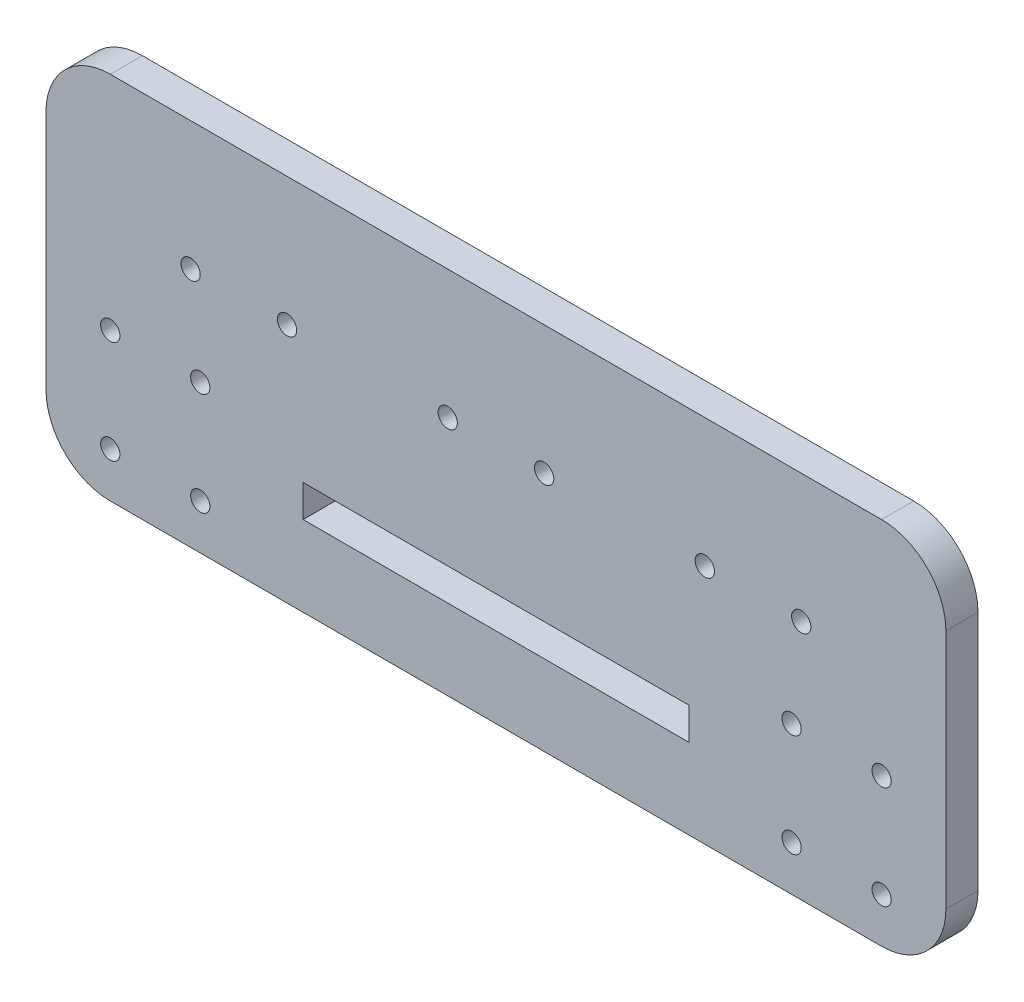
ISO-10303-21;
HEADER;
FILE_DESCRIPTION(('STEP AP214'),'2;1');
FILE_NAME('part.step','',(''),(''),'','','');
FILE_SCHEMA(('AUTOMOTIVE_DESIGN { 1 0 10303 214 1 1 1 1 }'));
ENDSEC;
DATA;
#1=APPLICATION_CONTEXT('core data for automotive mechanical design processes');
#2=APPLICATION_PROTOCOL_DEFINITION('international standard','automotive_design',2000,#1);
#3=PRODUCT_CONTEXT('',#1,'mechanical');
#4=PRODUCT('Part','Part','',(#3));
#5=PRODUCT_RELATED_PRODUCT_CATEGORY('part','',(#4));
#6=PRODUCT_DEFINITION_FORMATION('','',#4);
#7=PRODUCT_DEFINITION_CONTEXT('part definition',#1,'design');
#8=PRODUCT_DEFINITION('design','',#6,#7);
#9=PRODUCT_DEFINITION_SHAPE('','',#8);
#10=(LENGTH_UNIT() NAMED_UNIT(*) SI_UNIT(.MILLI.,.METRE.));
#11=(NAMED_UNIT(*) PLANE_ANGLE_UNIT() SI_UNIT($,.RADIAN.));
#12=(NAMED_UNIT(*) SI_UNIT($,.STERADIAN.) SOLID_ANGLE_UNIT());
#13=UNCERTAINTY_MEASURE_WITH_UNIT(LENGTH_MEASURE(1.E-05),#10,'distance_accuracy_value','');
#14=(GEOMETRIC_REPRESENTATION_CONTEXT(3) GLOBAL_UNCERTAINTY_ASSIGNED_CONTEXT((#13)) GLOBAL_UNIT_ASSIGNED_CONTEXT((#10,
#11,#12)) REPRESENTATION_CONTEXT('',''));
#15=CARTESIAN_POINT('',(0.,0.,0.));
#16=DIRECTION('',(0.,0.,1.));
#17=DIRECTION('',(1.,0.,0.));
#18=AXIS2_PLACEMENT_3D('',#15,#16,#17);
#19=CARTESIAN_POINT('',(-60.,-18.75,5.));
#20=DIRECTION('',(0.,0.,-1.));
#21=DIRECTION('',(-1.,0.,0.));
#22=AXIS2_PLACEMENT_3D('',#19,#20,#21);
#23=CYLINDRICAL_SURFACE('',#22,10.);
#24=CARTESIAN_POINT('',(-60.,-18.75,0.));
#25=DIRECTION('',(0.,0.,1.));
#26=DIRECTION('',(1.,0.,0.));
#27=AXIS2_PLACEMENT_3D('',#24,#25,#26);
#28=CIRCLE('',#27,10.);
#29=CARTESIAN_POINT('',(-70.,-18.75,0.));
#30=VERTEX_POINT('',#29);
#31=CARTESIAN_POINT('',(-60.,-28.75,0.));
#32=VERTEX_POINT('',#31);
#33=EDGE_CURVE('E195',#30,#32,#28,.T.);
#34=ORIENTED_EDGE('',*,*,#33,.T.);
#35=DIRECTION('',(0.,0.,-1.));
#36=VECTOR('',#35,1.);
#37=CARTESIAN_POINT('',(-60.,-28.75,5.));
#38=LINE('',#37,#36);
#39=CARTESIAN_POINT('',(-60.,-28.75,5.));
#40=VERTEX_POINT('',#39);
#41=EDGE_CURVE('E11',#40,#32,#38,.T.);
#42=ORIENTED_EDGE('',*,*,#41,.F.);
#43=CARTESIAN_POINT('',(-60.,-18.75,5.));
#44=DIRECTION('',(0.,0.,1.));
#45=DIRECTION('',(1.,0.,0.));
#46=AXIS2_PLACEMENT_3D('',#43,#44,#45);
#47=CIRCLE('',#46,10.);
#48=CARTESIAN_POINT('',(-70.,-18.75,5.));
#49=VERTEX_POINT('',#48);
#50=EDGE_CURVE('E198',#49,#40,#47,.T.);
#51=ORIENTED_EDGE('',*,*,#50,.F.);
#52=DIRECTION('',(0.,0.,-1.));
#53=VECTOR('',#52,1.);
#54=CARTESIAN_POINT('',(-70.,-18.75,5.));
#55=LINE('',#54,#53);
#56=EDGE_CURVE('E216',#49,#30,#55,.T.);
#57=ORIENTED_EDGE('',*,*,#56,.T.);
#58=EDGE_LOOP('',(#34,#42,#51,#57));
#59=FACE_BOUND('',#58,.T.);
#60=ADVANCED_FACE('F38',(#59),#23,.T.);
#61=CARTESIAN_POINT('',(-60.,-28.75,5.));
#62=DIRECTION('',(0.,1.,0.));
#63=DIRECTION('',(0.,0.,1.));
#64=AXIS2_PLACEMENT_3D('',#61,#62,#63);
#65=PLANE('',#64);
#66=DIRECTION('',(1.,0.,0.));
#67=VECTOR('',#66,1.);
#68=CARTESIAN_POINT('',(-60.,-28.75,0.));
#69=LINE('',#68,#67);
#70=CARTESIAN_POINT('',(60.,-28.75,0.));
#71=VERTEX_POINT('',#70);
#72=EDGE_CURVE('E219',#32,#71,#69,.T.);
#73=ORIENTED_EDGE('',*,*,#72,.T.);
#74=DIRECTION('',(0.,0.,-1.));
#75=VECTOR('',#74,1.);
#76=CARTESIAN_POINT('',(60.,-28.75,5.));
#77=LINE('',#76,#75);
#78=CARTESIAN_POINT('',(60.,-28.75,5.));
#79=VERTEX_POINT('',#78);
#80=EDGE_CURVE('E45',#79,#71,#77,.T.);
#81=ORIENTED_EDGE('',*,*,#80,.F.);
#82=DIRECTION('',(1.,0.,0.));
#83=VECTOR('',#82,1.);
#84=CARTESIAN_POINT('',(-60.,-28.75,5.));
#85=LINE('',#84,#83);
#86=EDGE_CURVE('E201',#40,#79,#85,.T.);
#87=ORIENTED_EDGE('',*,*,#86,.F.);
#88=ORIENTED_EDGE('',*,*,#41,.T.);
#89=EDGE_LOOP('',(#73,#81,#87,#88));
#90=FACE_BOUND('',#89,.T.);
#91=ADVANCED_FACE('F275',(#90),#65,.F.);
#92=CARTESIAN_POINT('',(60.,-18.75,5.));
#93=DIRECTION('',(0.,0.,-1.));
#94=DIRECTION('',(-1.,0.,0.));
#95=AXIS2_PLACEMENT_3D('',#92,#93,#94);
#96=CYLINDRICAL_SURFACE('',#95,10.);
#97=CARTESIAN_POINT('',(60.,-18.75,0.));
#98=DIRECTION('',(0.,0.,1.));
#99=DIRECTION('',(1.,0.,0.));
#100=AXIS2_PLACEMENT_3D('',#97,#98,#99);
#101=CIRCLE('',#100,10.);
#102=CARTESIAN_POINT('',(70.,-18.75,0.));
#103=VERTEX_POINT('',#102);
#104=EDGE_CURVE('E221',#71,#103,#101,.T.);
#105=ORIENTED_EDGE('',*,*,#104,.T.);
#106=DIRECTION('',(0.,0.,-1.));
#107=VECTOR('',#106,1.);
#108=CARTESIAN_POINT('',(70.,-18.75,5.));
#109=LINE('',#108,#107);
#110=CARTESIAN_POINT('',(70.,-18.75,5.));
#111=VERTEX_POINT('',#110);
#112=EDGE_CURVE('E246',#111,#103,#109,.T.);
#113=ORIENTED_EDGE('',*,*,#112,.F.);
#114=CARTESIAN_POINT('',(60.,-18.75,5.));
#115=DIRECTION('',(0.,0.,1.));
#116=DIRECTION('',(1.,0.,0.));
#117=AXIS2_PLACEMENT_3D('',#114,#115,#116);
#118=CIRCLE('',#117,10.);
#119=EDGE_CURVE('E204',#79,#111,#118,.T.);
#120=ORIENTED_EDGE('',*,*,#119,.F.);
#121=ORIENTED_EDGE('',*,*,#80,.T.);
#122=EDGE_LOOP('',(#105,#113,#120,#121));
#123=FACE_BOUND('',#122,.T.);
#124=ADVANCED_FACE('F253',(#123),#96,.T.);
#125=CARTESIAN_POINT('',(70.,18.75,5.));
#126=DIRECTION('',(-1.,0.,0.));
#127=DIRECTION('',(0.,0.,1.));
#128=AXIS2_PLACEMENT_3D('',#125,#126,#127);
#129=PLANE('',#128);
#130=DIRECTION('',(0.,1.,0.));
#131=VECTOR('',#130,1.);
#132=CARTESIAN_POINT('',(70.,18.75,0.));
#133=LINE('',#132,#131);
#134=CARTESIAN_POINT('',(70.,18.75,0.));
#135=VERTEX_POINT('',#134);
#136=EDGE_CURVE('E223',#103,#135,#133,.T.);
#137=ORIENTED_EDGE('',*,*,#136,.T.);
#138=DIRECTION('',(0.,0.,-1.));
#139=VECTOR('',#138,1.);
#140=CARTESIAN_POINT('',(70.,18.75,5.));
#141=LINE('',#140,#139);
#142=CARTESIAN_POINT('',(70.,18.75,5.));
#143=VERTEX_POINT('',#142);
#144=EDGE_CURVE('E243',#143,#135,#141,.T.);
#145=ORIENTED_EDGE('',*,*,#144,.F.);
#146=DIRECTION('',(0.,1.,0.));
#147=VECTOR('',#146,1.);
#148=CARTESIAN_POINT('',(70.,18.75,5.));
#149=LINE('',#148,#147);
#150=EDGE_CURVE('E206',#111,#143,#149,.T.);
#151=ORIENTED_EDGE('',*,*,#150,.F.);
#152=ORIENTED_EDGE('',*,*,#112,.T.);
#153=EDGE_LOOP('',(#137,#145,#151,#152));
#154=FACE_BOUND('',#153,.T.);
#155=ADVANCED_FACE('F263',(#154),#129,.F.);
#156=CARTESIAN_POINT('',(60.,18.75,5.));
#157=DIRECTION('',(0.,0.,-1.));
#158=DIRECTION('',(-1.,0.,0.));
#159=AXIS2_PLACEMENT_3D('',#156,#157,#158);
#160=CYLINDRICAL_SURFACE('',#159,10.);
#161=CARTESIAN_POINT('',(60.,18.75,0.));
#162=DIRECTION('',(0.,0.,1.));
#163=DIRECTION('',(-1.,0.,0.));
#164=AXIS2_PLACEMENT_3D('',#161,#162,#163);
#165=CIRCLE('',#164,10.);
#166=CARTESIAN_POINT('',(60.,28.75,0.));
#167=VERTEX_POINT('',#166);
#168=EDGE_CURVE('E225',#135,#167,#165,.T.);
#169=ORIENTED_EDGE('',*,*,#168,.T.);
#170=DIRECTION('',(0.,0.,-1.));
#171=VECTOR('',#170,1.);
#172=CARTESIAN_POINT('',(60.,28.75,5.));
#173=LINE('',#172,#171);
#174=CARTESIAN_POINT('',(60.,28.75,5.));
#175=VERTEX_POINT('',#174);
#176=EDGE_CURVE('E240',#175,#167,#173,.T.);
#177=ORIENTED_EDGE('',*,*,#176,.F.);
#178=CARTESIAN_POINT('',(60.,18.75,5.));
#179=DIRECTION('',(0.,0.,1.));
#180=DIRECTION('',(-1.,0.,0.));
#181=AXIS2_PLACEMENT_3D('',#178,#179,#180);
#182=CIRCLE('',#181,10.);
#183=EDGE_CURVE('E208',#143,#175,#182,.T.);
#184=ORIENTED_EDGE('',*,*,#183,.F.);
#185=ORIENTED_EDGE('',*,*,#144,.T.);
#186=EDGE_LOOP('',(#169,#177,#184,#185));
#187=FACE_BOUND('',#186,.T.);
#188=ADVANCED_FACE('F267',(#187),#160,.T.);
#189=CARTESIAN_POINT('',(-60.,28.75,5.));
#190=DIRECTION('',(0.,-1.,0.));
#191=DIRECTION('',(0.,0.,-1.));
#192=AXIS2_PLACEMENT_3D('',#189,#190,#191);
#193=PLANE('',#192);
#194=DIRECTION('',(-1.,0.,0.));
#195=VECTOR('',#194,1.);
#196=CARTESIAN_POINT('',(-60.,28.75,0.));
#197=LINE('',#196,#195);
#198=CARTESIAN_POINT('',(-60.,28.75,0.));
#199=VERTEX_POINT('',#198);
#200=EDGE_CURVE('E227',#167,#199,#197,.T.);
#201=ORIENTED_EDGE('',*,*,#200,.T.);
#202=DIRECTION('',(0.,0.,-1.));
#203=VECTOR('',#202,1.);
#204=CARTESIAN_POINT('',(-60.,28.75,5.));
#205=LINE('',#204,#203);
#206=CARTESIAN_POINT('',(-60.,28.75,5.));
#207=VERTEX_POINT('',#206);
#208=EDGE_CURVE('E237',#207,#199,#205,.T.);
#209=ORIENTED_EDGE('',*,*,#208,.F.);
#210=DIRECTION('',(-1.,0.,0.));
#211=VECTOR('',#210,1.);
#212=CARTESIAN_POINT('',(-60.,28.75,5.));
#213=LINE('',#212,#211);
#214=EDGE_CURVE('E210',#175,#207,#213,.T.);
#215=ORIENTED_EDGE('',*,*,#214,.F.);
#216=ORIENTED_EDGE('',*,*,#176,.T.);
#217=EDGE_LOOP('',(#201,#209,#215,#216));
#218=FACE_BOUND('',#217,.T.);
#219=ADVANCED_FACE('F288',(#218),#193,.F.);
#220=CARTESIAN_POINT('',(-60.,18.75,5.));
#221=DIRECTION('',(0.,0.,-1.));
#222=DIRECTION('',(-1.,0.,0.));
#223=AXIS2_PLACEMENT_3D('',#220,#221,#222);
#224=CYLINDRICAL_SURFACE('',#223,10.);
#225=CARTESIAN_POINT('',(-60.,18.75,0.));
#226=DIRECTION('',(0.,0.,1.));
#227=DIRECTION('',(1.,0.,0.));
#228=AXIS2_PLACEMENT_3D('',#225,#226,#227);
#229=CIRCLE('',#228,10.);
#230=CARTESIAN_POINT('',(-70.,18.75,0.));
#231=VERTEX_POINT('',#230);
#232=EDGE_CURVE('E229',#199,#231,#229,.T.);
#233=ORIENTED_EDGE('',*,*,#232,.T.);
#234=DIRECTION('',(0.,0.,-1.));
#235=VECTOR('',#234,1.);
#236=CARTESIAN_POINT('',(-70.,18.75,5.));
#237=LINE('',#236,#235);
#238=CARTESIAN_POINT('',(-70.,18.75,5.));
#239=VERTEX_POINT('',#238);
#240=EDGE_CURVE('E234',#239,#231,#237,.T.);
#241=ORIENTED_EDGE('',*,*,#240,.F.);
#242=CARTESIAN_POINT('',(-60.,18.75,5.));
#243=DIRECTION('',(0.,0.,1.));
#244=DIRECTION('',(1.,0.,0.));
#245=AXIS2_PLACEMENT_3D('',#242,#243,#244);
#246=CIRCLE('',#245,10.);
#247=EDGE_CURVE('E212',#207,#239,#246,.T.);
#248=ORIENTED_EDGE('',*,*,#247,.F.);
#249=ORIENTED_EDGE('',*,*,#208,.T.);
#250=EDGE_LOOP('',(#233,#241,#248,#249));
#251=FACE_BOUND('',#250,.T.);
#252=ADVANCED_FACE('F286',(#251),#224,.T.);
#253=CARTESIAN_POINT('',(-70.,18.75,5.));
#254=DIRECTION('',(1.,0.,0.));
#255=DIRECTION('',(0.,1.,0.));
#256=AXIS2_PLACEMENT_3D('',#253,#254,#255);
#257=PLANE('',#256);
#258=DIRECTION('',(0.,-1.,0.));
#259=VECTOR('',#258,1.);
#260=CARTESIAN_POINT('',(-70.,18.75,0.));
#261=LINE('',#260,#259);
#262=EDGE_CURVE('E202',#231,#30,#261,.T.);
#263=ORIENTED_EDGE('',*,*,#262,.T.);
#264=ORIENTED_EDGE('',*,*,#56,.F.);
#265=DIRECTION('',(0.,-1.,0.));
#266=VECTOR('',#265,1.);
#267=CARTESIAN_POINT('',(-70.,18.75,5.));
#268=LINE('',#267,#266);
#269=EDGE_CURVE('E214',#239,#49,#268,.T.);
#270=ORIENTED_EDGE('',*,*,#269,.F.);
#271=ORIENTED_EDGE('',*,*,#240,.T.);
#272=EDGE_LOOP('',(#263,#264,#270,#271));
#273=FACE_BOUND('',#272,.T.);
#274=ADVANCED_FACE('F281',(#273),#257,.F.);
#275=CARTESIAN_POINT('',(-60.,-18.75,5.));
#276=DIRECTION('',(0.,0.,1.));
#277=DIRECTION('',(1.,0.,0.));
#278=AXIS2_PLACEMENT_3D('',#275,#276,#277);
#279=PLANE('',#278);
#280=CARTESIAN_POINT('',(-47.5,8.75000000000002,5.));
#281=DIRECTION('',(0.,0.,1.));
#282=DIRECTION('',(-1.,0.,0.));
#283=AXIS2_PLACEMENT_3D('',#280,#281,#282);
#284=CIRCLE('',#283,1.5);
#285=CARTESIAN_POINT('',(-49.,8.75000000000002,5.));
#286=VERTEX_POINT('',#285);
#287=EDGE_CURVE('E532',#286,#286,#284,.T.);
#288=ORIENTED_EDGE('',*,*,#287,.F.);
#289=EDGE_LOOP('',(#288));
#290=FACE_BOUND('',#289,.T.);
#291=CARTESIAN_POINT('',(-7.5,8.74999999999999,5.));
#292=DIRECTION('',(0.,0.,1.));
#293=DIRECTION('',(-1.,0.,0.));
#294=AXIS2_PLACEMENT_3D('',#291,#292,#293);
#295=CIRCLE('',#294,1.5);
#296=CARTESIAN_POINT('',(-9.,8.74999999999999,5.));
#297=VERTEX_POINT('',#296);
#298=EDGE_CURVE('E581',#297,#297,#295,.T.);
#299=ORIENTED_EDGE('',*,*,#298,.F.);
#300=EDGE_LOOP('',(#299));
#301=FACE_BOUND('',#300,.T.);
#302=CARTESIAN_POINT('',(47.5,8.75000000000002,5.));
#303=DIRECTION('',(0.,0.,1.));
#304=DIRECTION('',(1.,0.,0.));
#305=AXIS2_PLACEMENT_3D('',#302,#303,#304);
#306=CIRCLE('',#305,1.5);
#307=CARTESIAN_POINT('',(49.,8.75000000000002,5.));
#308=VERTEX_POINT('',#307);
#309=EDGE_CURVE('E592',#308,#308,#306,.T.);
#310=ORIENTED_EDGE('',*,*,#309,.F.);
#311=EDGE_LOOP('',(#310));
#312=FACE_BOUND('',#311,.T.);
#313=CARTESIAN_POINT('',(32.5,8.75000000000002,5.));
#314=DIRECTION('',(0.,0.,1.));
#315=DIRECTION('',(-1.,0.,0.));
#316=AXIS2_PLACEMENT_3D('',#313,#314,#315);
#317=CIRCLE('',#316,1.5);
#318=CARTESIAN_POINT('',(31.,8.75000000000002,5.));
#319=VERTEX_POINT('',#318);
#320=EDGE_CURVE('E598',#319,#319,#317,.T.);
#321=ORIENTED_EDGE('',*,*,#320,.F.);
#322=EDGE_LOOP('',(#321));
#323=FACE_BOUND('',#322,.T.);
#324=CARTESIAN_POINT('',(-32.5,8.75000000000002,5.));
#325=DIRECTION('',(0.,0.,1.));
#326=DIRECTION('',(1.,0.,0.));
#327=AXIS2_PLACEMENT_3D('',#324,#325,#326);
#328=CIRCLE('',#327,1.5);
#329=CARTESIAN_POINT('',(-31.,8.75000000000002,5.));
#330=VERTEX_POINT('',#329);
#331=EDGE_CURVE('E534',#330,#330,#328,.T.);
#332=ORIENTED_EDGE('',*,*,#331,.F.);
#333=EDGE_LOOP('',(#332));
#334=FACE_BOUND('',#333,.T.);
#335=CARTESIAN_POINT('',(7.5,8.74999999999999,5.));
#336=DIRECTION('',(0.,0.,1.));
#337=DIRECTION('',(1.,0.,0.));
#338=AXIS2_PLACEMENT_3D('',#335,#336,#337);
#339=CIRCLE('',#338,1.5);
#340=CARTESIAN_POINT('',(9.,8.74999999999999,5.));
#341=VERTEX_POINT('',#340);
#342=EDGE_CURVE('E540',#341,#341,#339,.T.);
#343=ORIENTED_EDGE('',*,*,#342,.F.);
#344=EDGE_LOOP('',(#343));
#345=FACE_BOUND('',#344,.T.);
#346=CARTESIAN_POINT('',(-46.,-5.75000000000001,5.));
#347=DIRECTION('',(0.,0.,1.));
#348=DIRECTION('',(-1.,0.,0.));
#349=AXIS2_PLACEMENT_3D('',#346,#347,#348);
#350=CIRCLE('',#349,1.5);
#351=CARTESIAN_POINT('',(-47.5,-5.75000000000001,5.));
#352=VERTEX_POINT('',#351);
#353=EDGE_CURVE('E176',#352,#352,#350,.T.);
#354=ORIENTED_EDGE('',*,*,#353,.F.);
#355=EDGE_LOOP('',(#354));
#356=FACE_BOUND('',#355,.T.);
#357=CARTESIAN_POINT('',(60.,-21.75,5.));
#358=DIRECTION('',(0.,0.,1.));
#359=DIRECTION('',(1.,0.,0.));
#360=AXIS2_PLACEMENT_3D('',#357,#358,#359);
#361=CIRCLE('',#360,1.5);
#362=CARTESIAN_POINT('',(61.5,-21.75,5.));
#363=VERTEX_POINT('',#362);
#364=EDGE_CURVE('E170',#363,#363,#361,.T.);
#365=ORIENTED_EDGE('',*,*,#364,.F.);
#366=EDGE_LOOP('',(#365));
#367=FACE_BOUND('',#366,.T.);
#368=CARTESIAN_POINT('',(46.,-21.75,5.));
#369=DIRECTION('',(0.,0.,1.));
#370=DIRECTION('',(1.,0.,0.));
#371=AXIS2_PLACEMENT_3D('',#368,#369,#370);
#372=CIRCLE('',#371,1.5);
#373=CARTESIAN_POINT('',(47.5,-21.75,5.));
#374=VERTEX_POINT('',#373);
#375=EDGE_CURVE('E169',#374,#374,#372,.T.);
#376=ORIENTED_EDGE('',*,*,#375,.F.);
#377=EDGE_LOOP('',(#376));
#378=FACE_BOUND('',#377,.T.);
#379=CARTESIAN_POINT('',(46.,-5.75,5.));
#380=DIRECTION('',(0.,0.,1.));
#381=DIRECTION('',(1.,0.,0.));
#382=AXIS2_PLACEMENT_3D('',#379,#380,#381);
#383=CIRCLE('',#382,1.5);
#384=CARTESIAN_POINT('',(47.5,-5.75,5.));
#385=VERTEX_POINT('',#384);
#386=EDGE_CURVE('E184',#385,#385,#383,.T.);
#387=ORIENTED_EDGE('',*,*,#386,.F.);
#388=EDGE_LOOP('',(#387));
#389=FACE_BOUND('',#388,.T.);
#390=CARTESIAN_POINT('',(-46.,-21.75,5.));
#391=DIRECTION('',(0.,0.,1.));
#392=DIRECTION('',(-1.,0.,0.));
#393=AXIS2_PLACEMENT_3D('',#390,#391,#392);
#394=CIRCLE('',#393,1.5);
#395=CARTESIAN_POINT('',(-47.5,-21.75,5.));
#396=VERTEX_POINT('',#395);
#397=EDGE_CURVE('E546',#396,#396,#394,.T.);
#398=ORIENTED_EDGE('',*,*,#397,.F.);
#399=EDGE_LOOP('',(#398));
#400=FACE_BOUND('',#399,.T.);
#401=CARTESIAN_POINT('',(-60.,-21.75,5.));
#402=DIRECTION('',(0.,0.,1.));
#403=DIRECTION('',(-1.,0.,0.));
#404=AXIS2_PLACEMENT_3D('',#401,#402,#403);
#405=CIRCLE('',#404,1.5);
#406=CARTESIAN_POINT('',(-61.5,-21.75,5.));
#407=VERTEX_POINT('',#406);
#408=EDGE_CURVE('E552',#407,#407,#405,.T.);
#409=ORIENTED_EDGE('',*,*,#408,.F.);
#410=EDGE_LOOP('',(#409));
#411=FACE_BOUND('',#410,.T.);
#412=CARTESIAN_POINT('',(-60.,-5.75000000000001,5.));
#413=DIRECTION('',(0.,0.,1.));
#414=DIRECTION('',(-1.,0.,0.));
#415=AXIS2_PLACEMENT_3D('',#412,#413,#414);
#416=CIRCLE('',#415,1.5);
#417=CARTESIAN_POINT('',(-61.5,-5.75000000000001,5.));
#418=VERTEX_POINT('',#417);
#419=EDGE_CURVE('E150',#418,#418,#416,.T.);
#420=ORIENTED_EDGE('',*,*,#419,.F.);
#421=EDGE_LOOP('',(#420));
#422=FACE_BOUND('',#421,.T.);
#423=DIRECTION('',(0.,1.,0.));
#424=VECTOR('',#423,1.);
#425=CARTESIAN_POINT('',(30.,-11.25,5.));
#426=LINE('',#425,#424);
#427=CARTESIAN_POINT('',(30.,-16.25,5.));
#428=VERTEX_POINT('',#427);
#429=CARTESIAN_POINT('',(30.,-11.25,5.));
#430=VERTEX_POINT('',#429);
#431=EDGE_CURVE('E52',#428,#430,#426,.T.);
#432=ORIENTED_EDGE('',*,*,#431,.F.);
#433=DIRECTION('',(1.,0.,0.));
#434=VECTOR('',#433,1.);
#435=CARTESIAN_POINT('',(-30.,-16.25,5.));
#436=LINE('',#435,#434);
#437=CARTESIAN_POINT('',(-30.,-16.25,5.));
#438=VERTEX_POINT('',#437);
#439=EDGE_CURVE('E144',#438,#428,#436,.T.);
#440=ORIENTED_EDGE('',*,*,#439,.F.);
#441=DIRECTION('',(0.,-1.,0.));
#442=VECTOR('',#441,1.);
#443=CARTESIAN_POINT('',(-30.,-11.25,5.));
#444=LINE('',#443,#442);
#445=CARTESIAN_POINT('',(-30.,-11.25,5.));
#446=VERTEX_POINT('',#445);
#447=EDGE_CURVE('E147',#446,#438,#444,.T.);
#448=ORIENTED_EDGE('',*,*,#447,.F.);
#449=DIRECTION('',(-1.,0.,0.));
#450=VECTOR('',#449,1.);
#451=CARTESIAN_POINT('',(-30.,-11.25,5.));
#452=LINE('',#451,#450);
#453=EDGE_CURVE('E156',#430,#446,#452,.T.);
#454=ORIENTED_EDGE('',*,*,#453,.F.);
#455=EDGE_LOOP('',(#432,#440,#448,#454));
#456=FACE_BOUND('',#455,.T.);
#457=CARTESIAN_POINT('',(60.,-5.75,5.));
#458=DIRECTION('',(0.,0.,1.));
#459=DIRECTION('',(1.,0.,0.));
#460=AXIS2_PLACEMENT_3D('',#457,#458,#459);
#461=CIRCLE('',#460,1.5);
#462=CARTESIAN_POINT('',(61.5,-5.75,5.));
#463=VERTEX_POINT('',#462);
#464=EDGE_CURVE('E183',#463,#463,#461,.T.);
#465=ORIENTED_EDGE('',*,*,#464,.F.);
#466=EDGE_LOOP('',(#465));
#467=FACE_BOUND('',#466,.T.);
#468=ORIENTED_EDGE('',*,*,#50,.T.);
#469=ORIENTED_EDGE('',*,*,#86,.T.);
#470=ORIENTED_EDGE('',*,*,#119,.T.);
#471=ORIENTED_EDGE('',*,*,#150,.T.);
#472=ORIENTED_EDGE('',*,*,#183,.T.);
#473=ORIENTED_EDGE('',*,*,#214,.T.);
#474=ORIENTED_EDGE('',*,*,#247,.T.);
#475=ORIENTED_EDGE('',*,*,#269,.T.);
#476=EDGE_LOOP('',(#468,#469,#470,#471,#472,#473,#474,#475));
#477=FACE_BOUND('',#476,.T.);
#478=ADVANCED_FACE('F271',(#290,#301,#312,#323,#334,#345,#356,#367,#378,#389,#400,#411,#422,
#456,#467,#477),#279,.T.);
#479=CARTESIAN_POINT('',(-60.,-18.75,0.));
#480=DIRECTION('',(0.,0.,1.));
#481=DIRECTION('',(1.,0.,0.));
#482=AXIS2_PLACEMENT_3D('',#479,#480,#481);
#483=PLANE('',#482);
#484=CARTESIAN_POINT('',(-47.5,8.75000000000002,0.));
#485=DIRECTION('',(0.,0.,1.));
#486=DIRECTION('',(-1.,0.,0.));
#487=AXIS2_PLACEMENT_3D('',#484,#485,#486);
#488=CIRCLE('',#487,1.5);
#489=CARTESIAN_POINT('',(-49.,8.75000000000002,0.));
#490=VERTEX_POINT('',#489);
#491=EDGE_CURVE('E529',#490,#490,#488,.T.);
#492=ORIENTED_EDGE('',*,*,#491,.T.);
#493=EDGE_LOOP('',(#492));
#494=FACE_BOUND('',#493,.T.);
#495=CARTESIAN_POINT('',(-7.5,8.74999999999999,0.));
#496=DIRECTION('',(0.,0.,1.));
#497=DIRECTION('',(-1.,0.,0.));
#498=AXIS2_PLACEMENT_3D('',#495,#496,#497);
#499=CIRCLE('',#498,1.5);
#500=CARTESIAN_POINT('',(-9.,8.74999999999999,0.));
#501=VERTEX_POINT('',#500);
#502=EDGE_CURVE('E543',#501,#501,#499,.T.);
#503=ORIENTED_EDGE('',*,*,#502,.T.);
#504=EDGE_LOOP('',(#503));
#505=FACE_BOUND('',#504,.T.);
#506=CARTESIAN_POINT('',(47.5,8.75000000000002,0.));
#507=DIRECTION('',(0.,0.,1.));
#508=DIRECTION('',(1.,0.,0.));
#509=AXIS2_PLACEMENT_3D('',#506,#507,#508);
#510=CIRCLE('',#509,1.5);
#511=CARTESIAN_POINT('',(49.,8.75000000000002,0.));
#512=VERTEX_POINT('',#511);
#513=EDGE_CURVE('E586',#512,#512,#510,.T.);
#514=ORIENTED_EDGE('',*,*,#513,.T.);
#515=EDGE_LOOP('',(#514));
#516=FACE_BOUND('',#515,.T.);
#517=CARTESIAN_POINT('',(32.5,8.75000000000002,0.));
#518=DIRECTION('',(0.,0.,1.));
#519=DIRECTION('',(-1.,0.,0.));
#520=AXIS2_PLACEMENT_3D('',#517,#518,#519);
#521=CIRCLE('',#520,1.5);
#522=CARTESIAN_POINT('',(31.,8.75000000000002,0.));
#523=VERTEX_POINT('',#522);
#524=EDGE_CURVE('E594',#523,#523,#521,.T.);
#525=ORIENTED_EDGE('',*,*,#524,.T.);
#526=EDGE_LOOP('',(#525));
#527=FACE_BOUND('',#526,.T.);
#528=CARTESIAN_POINT('',(-32.5,8.75000000000002,0.));
#529=DIRECTION('',(0.,0.,1.));
#530=DIRECTION('',(1.,0.,0.));
#531=AXIS2_PLACEMENT_3D('',#528,#529,#530);
#532=CIRCLE('',#531,1.5);
#533=CARTESIAN_POINT('',(-31.,8.75000000000002,0.));
#534=VERTEX_POINT('',#533);
#535=EDGE_CURVE('E603',#534,#534,#532,.T.);
#536=ORIENTED_EDGE('',*,*,#535,.T.);
#537=EDGE_LOOP('',(#536));
#538=FACE_BOUND('',#537,.T.);
#539=CARTESIAN_POINT('',(7.5,8.74999999999999,0.));
#540=DIRECTION('',(0.,0.,1.));
#541=DIRECTION('',(1.,0.,0.));
#542=AXIS2_PLACEMENT_3D('',#539,#540,#541);
#543=CIRCLE('',#542,1.5);
#544=CARTESIAN_POINT('',(9.,8.74999999999999,0.));
#545=VERTEX_POINT('',#544);
#546=EDGE_CURVE('E157',#545,#545,#543,.T.);
#547=ORIENTED_EDGE('',*,*,#546,.T.);
#548=EDGE_LOOP('',(#547));
#549=FACE_BOUND('',#548,.T.);
#550=CARTESIAN_POINT('',(-46.,-5.75000000000001,0.));
#551=DIRECTION('',(0.,0.,1.));
#552=DIRECTION('',(-1.,0.,0.));
#553=AXIS2_PLACEMENT_3D('',#550,#551,#552);
#554=CIRCLE('',#553,1.5);
#555=CARTESIAN_POINT('',(-47.5,-5.75000000000001,0.));
#556=VERTEX_POINT('',#555);
#557=EDGE_CURVE('E173',#556,#556,#554,.T.);
#558=ORIENTED_EDGE('',*,*,#557,.T.);
#559=EDGE_LOOP('',(#558));
#560=FACE_BOUND('',#559,.T.);
#561=CARTESIAN_POINT('',(60.,-21.75,0.));
#562=DIRECTION('',(0.,0.,1.));
#563=DIRECTION('',(1.,0.,0.));
#564=AXIS2_PLACEMENT_3D('',#561,#562,#563);
#565=CIRCLE('',#564,1.5);
#566=CARTESIAN_POINT('',(61.5,-21.75,0.));
#567=VERTEX_POINT('',#566);
#568=EDGE_CURVE('E166',#567,#567,#565,.T.);
#569=ORIENTED_EDGE('',*,*,#568,.T.);
#570=EDGE_LOOP('',(#569));
#571=FACE_BOUND('',#570,.T.);
#572=CARTESIAN_POINT('',(46.,-21.75,0.));
#573=DIRECTION('',(0.,0.,1.));
#574=DIRECTION('',(1.,0.,0.));
#575=AXIS2_PLACEMENT_3D('',#572,#573,#574);
#576=CIRCLE('',#575,1.5);
#577=CARTESIAN_POINT('',(47.5,-21.75,0.));
#578=VERTEX_POINT('',#577);
#579=EDGE_CURVE('E187',#578,#578,#576,.T.);
#580=ORIENTED_EDGE('',*,*,#579,.T.);
#581=EDGE_LOOP('',(#580));
#582=FACE_BOUND('',#581,.T.);
#583=CARTESIAN_POINT('',(46.,-5.75,0.));
#584=DIRECTION('',(0.,0.,1.));
#585=DIRECTION('',(1.,0.,0.));
#586=AXIS2_PLACEMENT_3D('',#583,#584,#585);
#587=CIRCLE('',#586,1.5);
#588=CARTESIAN_POINT('',(47.5,-5.75,0.));
#589=VERTEX_POINT('',#588);
#590=EDGE_CURVE('E180',#589,#589,#587,.T.);
#591=ORIENTED_EDGE('',*,*,#590,.T.);
#592=EDGE_LOOP('',(#591));
#593=FACE_BOUND('',#592,.T.);
#594=CARTESIAN_POINT('',(-46.,-21.75,0.));
#595=DIRECTION('',(0.,0.,1.));
#596=DIRECTION('',(-1.,0.,0.));
#597=AXIS2_PLACEMENT_3D('',#594,#595,#596);
#598=CIRCLE('',#597,1.5);
#599=CARTESIAN_POINT('',(-47.5,-21.75,0.));
#600=VERTEX_POINT('',#599);
#601=EDGE_CURVE('E179',#600,#600,#598,.T.);
#602=ORIENTED_EDGE('',*,*,#601,.T.);
#603=EDGE_LOOP('',(#602));
#604=FACE_BOUND('',#603,.T.);
#605=CARTESIAN_POINT('',(-60.,-21.75,0.));
#606=DIRECTION('',(0.,0.,1.));
#607=DIRECTION('',(-1.,0.,0.));
#608=AXIS2_PLACEMENT_3D('',#605,#606,#607);
#609=CIRCLE('',#608,1.5);
#610=CARTESIAN_POINT('',(-61.5,-21.75,0.));
#611=VERTEX_POINT('',#610);
#612=EDGE_CURVE('E549',#611,#611,#609,.T.);
#613=ORIENTED_EDGE('',*,*,#612,.T.);
#614=EDGE_LOOP('',(#613));
#615=FACE_BOUND('',#614,.T.);
#616=CARTESIAN_POINT('',(-60.,-5.75000000000001,0.));
#617=DIRECTION('',(0.,0.,1.));
#618=DIRECTION('',(-1.,0.,0.));
#619=AXIS2_PLACEMENT_3D('',#616,#617,#618);
#620=CIRCLE('',#619,1.5);
#621=CARTESIAN_POINT('',(-61.5,-5.75000000000001,0.));
#622=VERTEX_POINT('',#621);
#623=EDGE_CURVE('E554',#622,#622,#620,.T.);
#624=ORIENTED_EDGE('',*,*,#623,.T.);
#625=EDGE_LOOP('',(#624));
#626=FACE_BOUND('',#625,.T.);
#627=DIRECTION('',(1.,0.,0.));
#628=VECTOR('',#627,1.);
#629=CARTESIAN_POINT('',(-30.,-16.25,0.));
#630=LINE('',#629,#628);
#631=CARTESIAN_POINT('',(-30.,-16.25,0.));
#632=VERTEX_POINT('',#631);
#633=CARTESIAN_POINT('',(30.,-16.25,0.));
#634=VERTEX_POINT('',#633);
#635=EDGE_CURVE('E134',#632,#634,#630,.T.);
#636=ORIENTED_EDGE('',*,*,#635,.T.);
#637=DIRECTION('',(0.,1.,0.));
#638=VECTOR('',#637,1.);
#639=CARTESIAN_POINT('',(30.,-11.25,0.));
#640=LINE('',#639,#638);
#641=CARTESIAN_POINT('',(30.,-11.25,0.));
#642=VERTEX_POINT('',#641);
#643=EDGE_CURVE('E128',#634,#642,#640,.T.);
#644=ORIENTED_EDGE('',*,*,#643,.T.);
#645=DIRECTION('',(-1.,0.,0.));
#646=VECTOR('',#645,1.);
#647=CARTESIAN_POINT('',(-30.,-11.25,0.));
#648=LINE('',#647,#646);
#649=CARTESIAN_POINT('',(-30.,-11.25,0.));
#650=VERTEX_POINT('',#649);
#651=EDGE_CURVE('E137',#642,#650,#648,.T.);
#652=ORIENTED_EDGE('',*,*,#651,.T.);
#653=DIRECTION('',(0.,-1.,0.));
#654=VECTOR('',#653,1.);
#655=CARTESIAN_POINT('',(-30.,-11.25,0.));
#656=LINE('',#655,#654);
#657=EDGE_CURVE('E60',#650,#632,#656,.T.);
#658=ORIENTED_EDGE('',*,*,#657,.T.);
#659=EDGE_LOOP('',(#636,#644,#652,#658));
#660=FACE_BOUND('',#659,.T.);
#661=CARTESIAN_POINT('',(60.,-5.75,0.));
#662=DIRECTION('',(0.,0.,1.));
#663=DIRECTION('',(1.,0.,0.));
#664=AXIS2_PLACEMENT_3D('',#661,#662,#663);
#665=CIRCLE('',#664,1.5);
#666=CARTESIAN_POINT('',(61.5,-5.75,0.));
#667=VERTEX_POINT('',#666);
#668=EDGE_CURVE('E192',#667,#667,#665,.T.);
#669=ORIENTED_EDGE('',*,*,#668,.T.);
#670=EDGE_LOOP('',(#669));
#671=FACE_BOUND('',#670,.T.);
#672=ORIENTED_EDGE('',*,*,#33,.F.);
#673=ORIENTED_EDGE('',*,*,#262,.F.);
#674=ORIENTED_EDGE('',*,*,#232,.F.);
#675=ORIENTED_EDGE('',*,*,#200,.F.);
#676=ORIENTED_EDGE('',*,*,#168,.F.);
#677=ORIENTED_EDGE('',*,*,#136,.F.);
#678=ORIENTED_EDGE('',*,*,#104,.F.);
#679=ORIENTED_EDGE('',*,*,#72,.F.);
#680=EDGE_LOOP('',(#672,#673,#674,#675,#676,#677,#678,#679));
#681=FACE_BOUND('',#680,.T.);
#682=ADVANCED_FACE('F141',(#494,#505,#516,#527,#538,#549,#560,#571,#582,#593,#604,#615,#626,
#660,#671,#681),#483,.F.);
#683=CARTESIAN_POINT('',(60.,-5.75,0.));
#684=DIRECTION('',(0.,0.,1.));
#685=DIRECTION('',(1.,0.,0.));
#686=AXIS2_PLACEMENT_3D('',#683,#684,#685);
#687=CYLINDRICAL_SURFACE('',#686,1.5);
#688=ORIENTED_EDGE('',*,*,#668,.F.);
#689=EDGE_LOOP('',(#688));
#690=FACE_BOUND('',#689,.T.);
#691=ORIENTED_EDGE('',*,*,#464,.T.);
#692=EDGE_LOOP('',(#691));
#693=FACE_BOUND('',#692,.T.);
#694=ADVANCED_FACE('F340',(#690,#693),#687,.F.);
#695=CARTESIAN_POINT('',(30.,-11.25,0.));
#696=DIRECTION('',(1.,0.,0.));
#697=DIRECTION('',(0.,0.,-1.));
#698=AXIS2_PLACEMENT_3D('',#695,#696,#697);
#699=PLANE('',#698);
#700=ORIENTED_EDGE('',*,*,#431,.T.);
#701=DIRECTION('',(0.,0.,1.));
#702=VECTOR('',#701,1.);
#703=CARTESIAN_POINT('',(30.,-11.25,0.));
#704=LINE('',#703,#702);
#705=EDGE_CURVE('E124',#642,#430,#704,.T.);
#706=ORIENTED_EDGE('',*,*,#705,.F.);
#707=ORIENTED_EDGE('',*,*,#643,.F.);
#708=DIRECTION('',(0.,0.,1.));
#709=VECTOR('',#708,1.);
#710=CARTESIAN_POINT('',(30.,-16.25,0.));
#711=LINE('',#710,#709);
#712=EDGE_CURVE('E161',#634,#428,#711,.T.);
#713=ORIENTED_EDGE('',*,*,#712,.T.);
#714=EDGE_LOOP('',(#700,#706,#707,#713));
#715=FACE_BOUND('',#714,.T.);
#716=ADVANCED_FACE('F126',(#715),#699,.F.);
#717=CARTESIAN_POINT('',(-30.,-16.25,0.));
#718=DIRECTION('',(0.,-1.,0.));
#719=DIRECTION('',(0.,0.,-1.));
#720=AXIS2_PLACEMENT_3D('',#717,#718,#719);
#721=PLANE('',#720);
#722=ORIENTED_EDGE('',*,*,#439,.T.);
#723=ORIENTED_EDGE('',*,*,#712,.F.);
#724=ORIENTED_EDGE('',*,*,#635,.F.);
#725=DIRECTION('',(0.,0.,1.));
#726=VECTOR('',#725,1.);
#727=CARTESIAN_POINT('',(-30.,-16.25,0.));
#728=LINE('',#727,#726);
#729=EDGE_CURVE('E163',#632,#438,#728,.T.);
#730=ORIENTED_EDGE('',*,*,#729,.T.);
#731=EDGE_LOOP('',(#722,#723,#724,#730));
#732=FACE_BOUND('',#731,.T.);
#733=ADVANCED_FACE('F356',(#732),#721,.F.);
#734=CARTESIAN_POINT('',(-30.,-11.25,0.));
#735=DIRECTION('',(-1.,0.,0.));
#736=DIRECTION('',(0.,0.,1.));
#737=AXIS2_PLACEMENT_3D('',#734,#735,#736);
#738=PLANE('',#737);
#739=ORIENTED_EDGE('',*,*,#447,.T.);
#740=ORIENTED_EDGE('',*,*,#729,.F.);
#741=ORIENTED_EDGE('',*,*,#657,.F.);
#742=DIRECTION('',(0.,0.,1.));
#743=VECTOR('',#742,1.);
#744=CARTESIAN_POINT('',(-30.,-11.25,0.));
#745=LINE('',#744,#743);
#746=EDGE_CURVE('E133',#650,#446,#745,.T.);
#747=ORIENTED_EDGE('',*,*,#746,.T.);
#748=EDGE_LOOP('',(#739,#740,#741,#747));
#749=FACE_BOUND('',#748,.T.);
#750=ADVANCED_FACE('F365',(#749),#738,.F.);
#751=CARTESIAN_POINT('',(-30.,-11.25,0.));
#752=DIRECTION('',(0.,1.,0.));
#753=DIRECTION('',(0.,0.,1.));
#754=AXIS2_PLACEMENT_3D('',#751,#752,#753);
#755=PLANE('',#754);
#756=ORIENTED_EDGE('',*,*,#453,.T.);
#757=ORIENTED_EDGE('',*,*,#746,.F.);
#758=ORIENTED_EDGE('',*,*,#651,.F.);
#759=ORIENTED_EDGE('',*,*,#705,.T.);
#760=EDGE_LOOP('',(#756,#757,#758,#759));
#761=FACE_BOUND('',#760,.T.);
#762=ADVANCED_FACE('F138',(#761),#755,.F.);
#763=CARTESIAN_POINT('',(-60.,-5.75000000000001,0.));
#764=DIRECTION('',(0.,0.,1.));
#765=DIRECTION('',(1.,0.,0.));
#766=AXIS2_PLACEMENT_3D('',#763,#764,#765);
#767=CYLINDRICAL_SURFACE('',#766,1.5);
#768=ORIENTED_EDGE('',*,*,#623,.F.);
#769=EDGE_LOOP('',(#768));
#770=FACE_BOUND('',#769,.T.);
#771=ORIENTED_EDGE('',*,*,#419,.T.);
#772=EDGE_LOOP('',(#771));
#773=FACE_BOUND('',#772,.T.);
#774=ADVANCED_FACE('F383',(#770,#773),#767,.F.);
#775=CARTESIAN_POINT('',(-60.,-21.75,0.));
#776=DIRECTION('',(0.,0.,1.));
#777=DIRECTION('',(1.,0.,0.));
#778=AXIS2_PLACEMENT_3D('',#775,#776,#777);
#779=CYLINDRICAL_SURFACE('',#778,1.5);
#780=ORIENTED_EDGE('',*,*,#612,.F.);
#781=EDGE_LOOP('',(#780));
#782=FACE_BOUND('',#781,.T.);
#783=ORIENTED_EDGE('',*,*,#408,.T.);
#784=EDGE_LOOP('',(#783));
#785=FACE_BOUND('',#784,.T.);
#786=ADVANCED_FACE('F392',(#782,#785),#779,.F.);
#787=CARTESIAN_POINT('',(-46.,-21.75,0.));
#788=DIRECTION('',(0.,0.,1.));
#789=DIRECTION('',(1.,0.,0.));
#790=AXIS2_PLACEMENT_3D('',#787,#788,#789);
#791=CYLINDRICAL_SURFACE('',#790,1.5);
#792=ORIENTED_EDGE('',*,*,#601,.F.);
#793=EDGE_LOOP('',(#792));
#794=FACE_BOUND('',#793,.T.);
#795=ORIENTED_EDGE('',*,*,#397,.T.);
#796=EDGE_LOOP('',(#795));
#797=FACE_BOUND('',#796,.T.);
#798=ADVANCED_FACE('F402',(#794,#797),#791,.F.);
#799=CARTESIAN_POINT('',(46.,-5.75,0.));
#800=DIRECTION('',(0.,0.,1.));
#801=DIRECTION('',(1.,0.,0.));
#802=AXIS2_PLACEMENT_3D('',#799,#800,#801);
#803=CYLINDRICAL_SURFACE('',#802,1.5);
#804=ORIENTED_EDGE('',*,*,#590,.F.);
#805=EDGE_LOOP('',(#804));
#806=FACE_BOUND('',#805,.T.);
#807=ORIENTED_EDGE('',*,*,#386,.T.);
#808=EDGE_LOOP('',(#807));
#809=FACE_BOUND('',#808,.T.);
#810=ADVANCED_FACE('F412',(#806,#809),#803,.F.);
#811=CARTESIAN_POINT('',(46.,-21.75,0.));
#812=DIRECTION('',(0.,0.,1.));
#813=DIRECTION('',(1.,0.,0.));
#814=AXIS2_PLACEMENT_3D('',#811,#812,#813);
#815=CYLINDRICAL_SURFACE('',#814,1.5);
#816=ORIENTED_EDGE('',*,*,#579,.F.);
#817=EDGE_LOOP('',(#816));
#818=FACE_BOUND('',#817,.T.);
#819=ORIENTED_EDGE('',*,*,#375,.T.);
#820=EDGE_LOOP('',(#819));
#821=FACE_BOUND('',#820,.T.);
#822=ADVANCED_FACE('F422',(#818,#821),#815,.F.);
#823=CARTESIAN_POINT('',(60.,-21.75,0.));
#824=DIRECTION('',(0.,0.,1.));
#825=DIRECTION('',(1.,0.,0.));
#826=AXIS2_PLACEMENT_3D('',#823,#824,#825);
#827=CYLINDRICAL_SURFACE('',#826,1.5);
#828=ORIENTED_EDGE('',*,*,#568,.F.);
#829=EDGE_LOOP('',(#828));
#830=FACE_BOUND('',#829,.T.);
#831=ORIENTED_EDGE('',*,*,#364,.T.);
#832=EDGE_LOOP('',(#831));
#833=FACE_BOUND('',#832,.T.);
#834=ADVANCED_FACE('F432',(#830,#833),#827,.F.);
#835=CARTESIAN_POINT('',(-46.,-5.75000000000001,0.));
#836=DIRECTION('',(0.,0.,1.));
#837=DIRECTION('',(1.,0.,0.));
#838=AXIS2_PLACEMENT_3D('',#835,#836,#837);
#839=CYLINDRICAL_SURFACE('',#838,1.5);
#840=ORIENTED_EDGE('',*,*,#557,.F.);
#841=EDGE_LOOP('',(#840));
#842=FACE_BOUND('',#841,.T.);
#843=ORIENTED_EDGE('',*,*,#353,.T.);
#844=EDGE_LOOP('',(#843));
#845=FACE_BOUND('',#844,.T.);
#846=ADVANCED_FACE('F442',(#842,#845),#839,.F.);
#847=CARTESIAN_POINT('',(7.5,8.74999999999999,0.));
#848=DIRECTION('',(0.,0.,1.));
#849=DIRECTION('',(1.,0.,0.));
#850=AXIS2_PLACEMENT_3D('',#847,#848,#849);
#851=CYLINDRICAL_SURFACE('',#850,1.5);
#852=ORIENTED_EDGE('',*,*,#546,.F.);
#853=EDGE_LOOP('',(#852));
#854=FACE_BOUND('',#853,.T.);
#855=ORIENTED_EDGE('',*,*,#342,.T.);
#856=EDGE_LOOP('',(#855));
#857=FACE_BOUND('',#856,.T.);
#858=ADVANCED_FACE('F452',(#854,#857),#851,.F.);
#859=CARTESIAN_POINT('',(-32.5,8.75000000000002,0.));
#860=DIRECTION('',(0.,0.,1.));
#861=DIRECTION('',(1.,0.,0.));
#862=AXIS2_PLACEMENT_3D('',#859,#860,#861);
#863=CYLINDRICAL_SURFACE('',#862,1.5);
#864=ORIENTED_EDGE('',*,*,#535,.F.);
#865=EDGE_LOOP('',(#864));
#866=FACE_BOUND('',#865,.T.);
#867=ORIENTED_EDGE('',*,*,#331,.T.);
#868=EDGE_LOOP('',(#867));
#869=FACE_BOUND('',#868,.T.);
#870=ADVANCED_FACE('F472',(#866,#869),#863,.F.);
#871=CARTESIAN_POINT('',(32.5,8.75000000000002,0.));
#872=DIRECTION('',(0.,0.,1.));
#873=DIRECTION('',(1.,0.,0.));
#874=AXIS2_PLACEMENT_3D('',#871,#872,#873);
#875=CYLINDRICAL_SURFACE('',#874,1.5);
#876=ORIENTED_EDGE('',*,*,#524,.F.);
#877=EDGE_LOOP('',(#876));
#878=FACE_BOUND('',#877,.T.);
#879=ORIENTED_EDGE('',*,*,#320,.T.);
#880=EDGE_LOOP('',(#879));
#881=FACE_BOUND('',#880,.T.);
#882=ADVANCED_FACE('F482',(#878,#881),#875,.F.);
#883=CARTESIAN_POINT('',(47.5,8.75000000000002,0.));
#884=DIRECTION('',(0.,0.,1.));
#885=DIRECTION('',(1.,0.,0.));
#886=AXIS2_PLACEMENT_3D('',#883,#884,#885);
#887=CYLINDRICAL_SURFACE('',#886,1.5);
#888=ORIENTED_EDGE('',*,*,#513,.F.);
#889=EDGE_LOOP('',(#888));
#890=FACE_BOUND('',#889,.T.);
#891=ORIENTED_EDGE('',*,*,#309,.T.);
#892=EDGE_LOOP('',(#891));
#893=FACE_BOUND('',#892,.T.);
#894=ADVANCED_FACE('F492',(#890,#893),#887,.F.);
#895=CARTESIAN_POINT('',(-7.5,8.74999999999999,0.));
#896=DIRECTION('',(0.,0.,1.));
#897=DIRECTION('',(1.,0.,0.));
#898=AXIS2_PLACEMENT_3D('',#895,#896,#897);
#899=CYLINDRICAL_SURFACE('',#898,1.5);
#900=ORIENTED_EDGE('',*,*,#502,.F.);
#901=EDGE_LOOP('',(#900));
#902=FACE_BOUND('',#901,.T.);
#903=ORIENTED_EDGE('',*,*,#298,.T.);
#904=EDGE_LOOP('',(#903));
#905=FACE_BOUND('',#904,.T.);
#906=ADVANCED_FACE('F502',(#902,#905),#899,.F.);
#907=CARTESIAN_POINT('',(-47.5,8.75000000000002,0.));
#908=DIRECTION('',(0.,0.,1.));
#909=DIRECTION('',(1.,0.,0.));
#910=AXIS2_PLACEMENT_3D('',#907,#908,#909);
#911=CYLINDRICAL_SURFACE('',#910,1.5);
#912=ORIENTED_EDGE('',*,*,#491,.F.);
#913=EDGE_LOOP('',(#912));
#914=FACE_BOUND('',#913,.T.);
#915=ORIENTED_EDGE('',*,*,#287,.T.);
#916=EDGE_LOOP('',(#915));
#917=FACE_BOUND('',#916,.T.);
#918=ADVANCED_FACE('F512',(#914,#917),#911,.F.);
#919=CLOSED_SHELL('',(#60,#91,#124,#155,#188,#219,#252,#274,#478,#682,#694,#716,#733,#750,#762,
#774,#786,#798,#810,#822,#834,#846,#858,#870,#882,#894,#906,#918));
#920=MANIFOLD_SOLID_BREP('B2',#919);
#921=ADVANCED_BREP_SHAPE_REPRESENTATION('',(#18,#920),#14);
#922=SHAPE_DEFINITION_REPRESENTATION(#9,#921);
ENDSEC;
END-ISO-10303-21;
